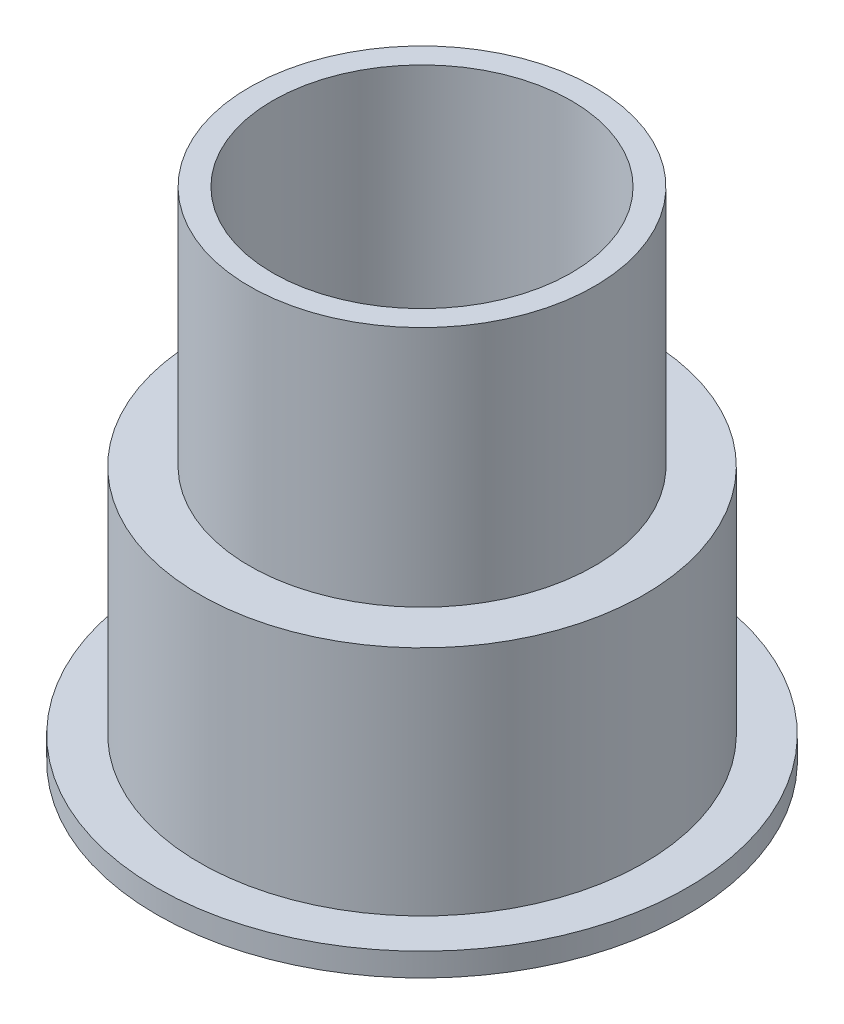
ISO-10303-21;
HEADER;
FILE_DESCRIPTION(('STEP AP214'),'2;1');
FILE_NAME('part.step','',(''),(''),'','','');
FILE_SCHEMA(('AUTOMOTIVE_DESIGN { 1 0 10303 214 1 1 1 1 }'));
ENDSEC;
DATA;
#1=APPLICATION_CONTEXT('core data for automotive mechanical design processes');
#2=APPLICATION_PROTOCOL_DEFINITION('international standard','automotive_design',2000,#1);
#3=PRODUCT_CONTEXT('',#1,'mechanical');
#4=PRODUCT('Part','Part','',(#3));
#5=PRODUCT_RELATED_PRODUCT_CATEGORY('part','',(#4));
#6=PRODUCT_DEFINITION_FORMATION('','',#4);
#7=PRODUCT_DEFINITION_CONTEXT('part definition',#1,'design');
#8=PRODUCT_DEFINITION('design','',#6,#7);
#9=PRODUCT_DEFINITION_SHAPE('','',#8);
#10=(LENGTH_UNIT() NAMED_UNIT(*) SI_UNIT(.MILLI.,.METRE.));
#11=(NAMED_UNIT(*) PLANE_ANGLE_UNIT() SI_UNIT($,.RADIAN.));
#12=(NAMED_UNIT(*) SI_UNIT($,.STERADIAN.) SOLID_ANGLE_UNIT());
#13=UNCERTAINTY_MEASURE_WITH_UNIT(LENGTH_MEASURE(1.E-05),#10,'distance_accuracy_value','');
#14=(GEOMETRIC_REPRESENTATION_CONTEXT(3) GLOBAL_UNCERTAINTY_ASSIGNED_CONTEXT((#13)) GLOBAL_UNIT_ASSIGNED_CONTEXT((#10,
#11,#12)) REPRESENTATION_CONTEXT('',''));
#15=CARTESIAN_POINT('',(0.,0.,0.));
#16=DIRECTION('',(0.,0.,1.));
#17=DIRECTION('',(1.,0.,0.));
#18=AXIS2_PLACEMENT_3D('',#15,#16,#17);
#19=CARTESIAN_POINT('',(6.,-0.854835863287098,0.));
#20=DIRECTION('',(0.,-1.,0.));
#21=DIRECTION('',(0.,0.,-1.));
#22=AXIS2_PLACEMENT_3D('',#19,#20,#21);
#23=PLANE('',#22);
#24=CARTESIAN_POINT('',(0.,-0.854835863287098,0.));
#25=DIRECTION('',(0.,-1.,0.));
#26=DIRECTION('',(0.,0.,-1.));
#27=AXIS2_PLACEMENT_3D('',#24,#25,#26);
#28=CIRCLE('',#27,8.);
#29=CARTESIAN_POINT('',(0.,-0.854835863287098,-8.));
#30=VERTEX_POINT('',#29);
#31=EDGE_CURVE('E10',#30,#30,#28,.T.);
#32=ORIENTED_EDGE('',*,*,#31,.T.);
#33=EDGE_LOOP('',(#32));
#34=FACE_BOUND('',#33,.T.);
#35=CARTESIAN_POINT('',(0.,-0.854835863287098,0.));
#36=DIRECTION('',(0.,-1.,0.));
#37=DIRECTION('',(0.,0.,-1.));
#38=AXIS2_PLACEMENT_3D('',#35,#36,#37);
#39=CIRCLE('',#38,6.);
#40=CARTESIAN_POINT('',(0.,-0.854835863287098,-6.));
#41=VERTEX_POINT('',#40);
#42=EDGE_CURVE('E71',#41,#41,#39,.T.);
#43=ORIENTED_EDGE('',*,*,#42,.F.);
#44=EDGE_LOOP('',(#43));
#45=FACE_BOUND('',#44,.T.);
#46=ADVANCED_FACE('F37',(#34,#45),#23,.T.);
#47=CARTESIAN_POINT('',(0.,0.,0.));
#48=DIRECTION('',(0.,-1.,0.));
#49=DIRECTION('',(0.,0.,-1.));
#50=AXIS2_PLACEMENT_3D('',#47,#48,#49);
#51=CYLINDRICAL_SURFACE('',#50,8.);
#52=CARTESIAN_POINT('',(0.,-0.154835863287098,0.));
#53=DIRECTION('',(0.,-1.,0.));
#54=DIRECTION('',(0.,0.,-1.));
#55=AXIS2_PLACEMENT_3D('',#52,#53,#54);
#56=CIRCLE('',#55,8.);
#57=CARTESIAN_POINT('',(0.,-0.154835863287098,-8.));
#58=VERTEX_POINT('',#57);
#59=EDGE_CURVE('E43',#58,#58,#56,.T.);
#60=ORIENTED_EDGE('',*,*,#59,.T.);
#61=EDGE_LOOP('',(#60));
#62=FACE_BOUND('',#61,.T.);
#63=ORIENTED_EDGE('',*,*,#31,.F.);
#64=EDGE_LOOP('',(#63));
#65=FACE_BOUND('',#64,.T.);
#66=ADVANCED_FACE('F79',(#62,#65),#51,.T.);
#67=CARTESIAN_POINT('',(6.7,-0.154835863287098,0.));
#68=DIRECTION('',(0.,1.,0.));
#69=DIRECTION('',(0.,0.,1.));
#70=AXIS2_PLACEMENT_3D('',#67,#68,#69);
#71=PLANE('',#70);
#72=CARTESIAN_POINT('',(0.,-0.154835863287098,0.));
#73=DIRECTION('',(0.,-1.,0.));
#74=DIRECTION('',(0.,0.,-1.));
#75=AXIS2_PLACEMENT_3D('',#72,#73,#74);
#76=CIRCLE('',#75,6.7);
#77=CARTESIAN_POINT('',(0.,-0.154835863287098,-6.7));
#78=VERTEX_POINT('',#77);
#79=EDGE_CURVE('E47',#78,#78,#76,.T.);
#80=ORIENTED_EDGE('',*,*,#79,.T.);
#81=EDGE_LOOP('',(#80));
#82=FACE_BOUND('',#81,.T.);
#83=ORIENTED_EDGE('',*,*,#59,.F.);
#84=EDGE_LOOP('',(#83));
#85=FACE_BOUND('',#84,.T.);
#86=ADVANCED_FACE('F83',(#82,#85),#71,.T.);
#87=CARTESIAN_POINT('',(0.,0.,0.));
#88=DIRECTION('',(0.,-1.,0.));
#89=DIRECTION('',(0.,0.,-1.));
#90=AXIS2_PLACEMENT_3D('',#87,#88,#89);
#91=CYLINDRICAL_SURFACE('',#90,6.7);
#92=CARTESIAN_POINT('',(0.,6.8451641367129,0.));
#93=DIRECTION('',(0.,-1.,0.));
#94=DIRECTION('',(0.,0.,-1.));
#95=AXIS2_PLACEMENT_3D('',#92,#93,#94);
#96=CIRCLE('',#95,6.7);
#97=CARTESIAN_POINT('',(0.,6.8451641367129,-6.7));
#98=VERTEX_POINT('',#97);
#99=EDGE_CURVE('E51',#98,#98,#96,.T.);
#100=ORIENTED_EDGE('',*,*,#99,.T.);
#101=EDGE_LOOP('',(#100));
#102=FACE_BOUND('',#101,.T.);
#103=ORIENTED_EDGE('',*,*,#79,.F.);
#104=EDGE_LOOP('',(#103));
#105=FACE_BOUND('',#104,.T.);
#106=ADVANCED_FACE('F87',(#102,#105),#91,.T.);
#107=CARTESIAN_POINT('',(6.7,6.8451641367129,0.));
#108=DIRECTION('',(0.,1.,0.));
#109=DIRECTION('',(0.,0.,1.));
#110=AXIS2_PLACEMENT_3D('',#107,#108,#109);
#111=PLANE('',#110);
#112=CARTESIAN_POINT('',(0.,6.8451641367129,0.));
#113=DIRECTION('',(0.,-1.,0.));
#114=DIRECTION('',(0.,0.,-1.));
#115=AXIS2_PLACEMENT_3D('',#112,#113,#114);
#116=CIRCLE('',#115,5.2);
#117=CARTESIAN_POINT('',(0.,6.8451641367129,-5.2));
#118=VERTEX_POINT('',#117);
#119=EDGE_CURVE('E56',#118,#118,#116,.T.);
#120=ORIENTED_EDGE('',*,*,#119,.T.);
#121=EDGE_LOOP('',(#120));
#122=FACE_BOUND('',#121,.T.);
#123=ORIENTED_EDGE('',*,*,#99,.F.);
#124=EDGE_LOOP('',(#123));
#125=FACE_BOUND('',#124,.T.);
#126=ADVANCED_FACE('F94',(#122,#125),#111,.T.);
#127=CARTESIAN_POINT('',(0.,0.,0.));
#128=DIRECTION('',(0.,-1.,0.));
#129=DIRECTION('',(0.,0.,-1.));
#130=AXIS2_PLACEMENT_3D('',#127,#128,#129);
#131=CYLINDRICAL_SURFACE('',#130,5.2);
#132=CARTESIAN_POINT('',(0.,14.1451641367129,0.));
#133=DIRECTION('',(0.,-1.,0.));
#134=DIRECTION('',(0.,0.,-1.));
#135=AXIS2_PLACEMENT_3D('',#132,#133,#134);
#136=CIRCLE('',#135,5.2);
#137=CARTESIAN_POINT('',(0.,14.1451641367129,-5.2));
#138=VERTEX_POINT('',#137);
#139=EDGE_CURVE('E59',#138,#138,#136,.T.);
#140=ORIENTED_EDGE('',*,*,#139,.T.);
#141=EDGE_LOOP('',(#140));
#142=FACE_BOUND('',#141,.T.);
#143=ORIENTED_EDGE('',*,*,#119,.F.);
#144=EDGE_LOOP('',(#143));
#145=FACE_BOUND('',#144,.T.);
#146=ADVANCED_FACE('F98',(#142,#145),#131,.T.);
#147=CARTESIAN_POINT('',(4.5,14.1451641367129,0.));
#148=DIRECTION('',(0.,1.,0.));
#149=DIRECTION('',(0.,0.,1.));
#150=AXIS2_PLACEMENT_3D('',#147,#148,#149);
#151=PLANE('',#150);
#152=CARTESIAN_POINT('',(0.,14.1451641367129,0.));
#153=DIRECTION('',(0.,-1.,0.));
#154=DIRECTION('',(0.,0.,-1.));
#155=AXIS2_PLACEMENT_3D('',#152,#153,#154);
#156=CIRCLE('',#155,4.5);
#157=CARTESIAN_POINT('',(0.,14.1451641367129,-4.5));
#158=VERTEX_POINT('',#157);
#159=EDGE_CURVE('E62',#158,#158,#156,.T.);
#160=ORIENTED_EDGE('',*,*,#159,.T.);
#161=EDGE_LOOP('',(#160));
#162=FACE_BOUND('',#161,.T.);
#163=ORIENTED_EDGE('',*,*,#139,.F.);
#164=EDGE_LOOP('',(#163));
#165=FACE_BOUND('',#164,.T.);
#166=ADVANCED_FACE('F102',(#162,#165),#151,.T.);
#167=CARTESIAN_POINT('',(0.,0.,0.));
#168=DIRECTION('',(0.,-1.,0.));
#169=DIRECTION('',(0.,0.,-1.));
#170=AXIS2_PLACEMENT_3D('',#167,#168,#169);
#171=CYLINDRICAL_SURFACE('',#170,4.5);
#172=CARTESIAN_POINT('',(0.,6.8451641367129,0.));
#173=DIRECTION('',(0.,-1.,0.));
#174=DIRECTION('',(0.,0.,-1.));
#175=AXIS2_PLACEMENT_3D('',#172,#173,#174);
#176=CIRCLE('',#175,4.5);
#177=CARTESIAN_POINT('',(0.,6.8451641367129,-4.5));
#178=VERTEX_POINT('',#177);
#179=EDGE_CURVE('E65',#178,#178,#176,.T.);
#180=ORIENTED_EDGE('',*,*,#179,.T.);
#181=EDGE_LOOP('',(#180));
#182=FACE_BOUND('',#181,.T.);
#183=ORIENTED_EDGE('',*,*,#159,.F.);
#184=EDGE_LOOP('',(#183));
#185=FACE_BOUND('',#184,.T.);
#186=ADVANCED_FACE('F106',(#182,#185),#171,.F.);
#187=CARTESIAN_POINT('',(4.5,6.8451641367129,0.));
#188=DIRECTION('',(0.,1.,0.));
#189=DIRECTION('',(0.,0.,1.));
#190=AXIS2_PLACEMENT_3D('',#187,#188,#189);
#191=PLANE('',#190);
#192=ORIENTED_EDGE('',*,*,#179,.F.);
#193=EDGE_LOOP('',(#192));
#194=FACE_BOUND('',#193,.T.);
#195=ADVANCED_FACE('F110',(#194),#191,.T.);
#196=CARTESIAN_POINT('',(6.,6.1451641367129,0.));
#197=DIRECTION('',(0.,-1.,0.));
#198=DIRECTION('',(0.,0.,-1.));
#199=AXIS2_PLACEMENT_3D('',#196,#197,#198);
#200=PLANE('',#199);
#201=CARTESIAN_POINT('',(0.,6.1451641367129,0.));
#202=DIRECTION('',(0.,-1.,0.));
#203=DIRECTION('',(0.,0.,-1.));
#204=AXIS2_PLACEMENT_3D('',#201,#202,#203);
#205=CIRCLE('',#204,6.);
#206=CARTESIAN_POINT('',(0.,6.1451641367129,-6.));
#207=VERTEX_POINT('',#206);
#208=EDGE_CURVE('E68',#207,#207,#205,.T.);
#209=ORIENTED_EDGE('',*,*,#208,.T.);
#210=EDGE_LOOP('',(#209));
#211=FACE_BOUND('',#210,.T.);
#212=ADVANCED_FACE('F114',(#211),#200,.T.);
#213=CARTESIAN_POINT('',(0.,0.,0.));
#214=DIRECTION('',(0.,-1.,0.));
#215=DIRECTION('',(0.,0.,-1.));
#216=AXIS2_PLACEMENT_3D('',#213,#214,#215);
#217=CYLINDRICAL_SURFACE('',#216,6.);
#218=ORIENTED_EDGE('',*,*,#42,.T.);
#219=EDGE_LOOP('',(#218));
#220=FACE_BOUND('',#219,.T.);
#221=ORIENTED_EDGE('',*,*,#208,.F.);
#222=EDGE_LOOP('',(#221));
#223=FACE_BOUND('',#222,.T.);
#224=ADVANCED_FACE('F75',(#220,#223),#217,.F.);
#225=CLOSED_SHELL('',(#46,#66,#86,#106,#126,#146,#166,#186,#195,#212,#224));
#226=MANIFOLD_SOLID_BREP('B2',#225);
#227=ADVANCED_BREP_SHAPE_REPRESENTATION('',(#18,#226),#14);
#228=SHAPE_DEFINITION_REPRESENTATION(#9,#227);
ENDSEC;
END-ISO-10303-21;
